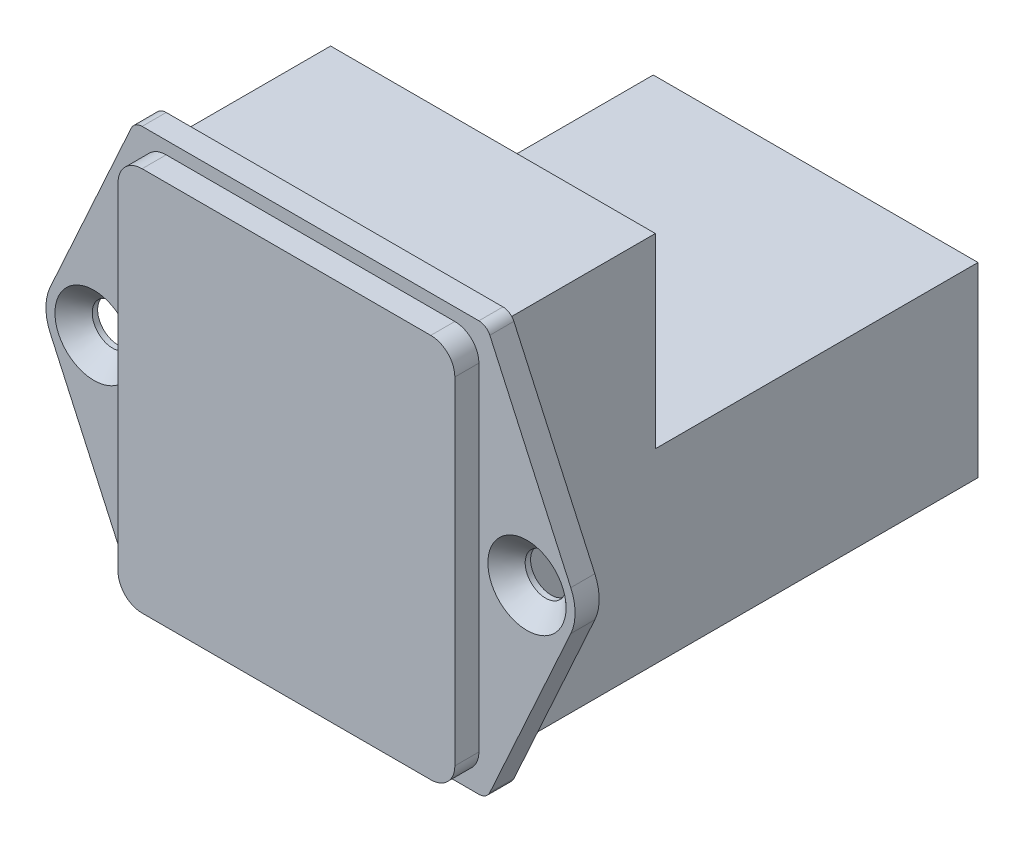
ISO-10303-21;
HEADER;
FILE_DESCRIPTION(('STEP AP214'),'2;1');
FILE_NAME('part.step','',(''),(''),'','','');
FILE_SCHEMA(('AUTOMOTIVE_DESIGN { 1 0 10303 214 1 1 1 1 }'));
ENDSEC;
DATA;
#1=APPLICATION_CONTEXT('core data for automotive mechanical design processes');
#2=APPLICATION_PROTOCOL_DEFINITION('international standard','automotive_design',2000,#1);
#3=PRODUCT_CONTEXT('',#1,'mechanical');
#4=PRODUCT('Part','Part','',(#3));
#5=PRODUCT_RELATED_PRODUCT_CATEGORY('part','',(#4));
#6=PRODUCT_DEFINITION_FORMATION('','',#4);
#7=PRODUCT_DEFINITION_CONTEXT('part definition',#1,'design');
#8=PRODUCT_DEFINITION('design','',#6,#7);
#9=PRODUCT_DEFINITION_SHAPE('','',#8);
#10=(LENGTH_UNIT() NAMED_UNIT(*) SI_UNIT(.MILLI.,.METRE.));
#11=(NAMED_UNIT(*) PLANE_ANGLE_UNIT() SI_UNIT($,.RADIAN.));
#12=(NAMED_UNIT(*) SI_UNIT($,.STERADIAN.) SOLID_ANGLE_UNIT());
#13=UNCERTAINTY_MEASURE_WITH_UNIT(LENGTH_MEASURE(1.E-05),#10,'distance_accuracy_value','');
#14=(GEOMETRIC_REPRESENTATION_CONTEXT(3) GLOBAL_UNCERTAINTY_ASSIGNED_CONTEXT((#13)) GLOBAL_UNIT_ASSIGNED_CONTEXT((#10,
#11,#12)) REPRESENTATION_CONTEXT('',''));
#15=CARTESIAN_POINT('',(0.,0.,0.));
#16=DIRECTION('',(0.,0.,1.));
#17=DIRECTION('',(1.,0.,0.));
#18=AXIS2_PLACEMENT_3D('',#15,#16,#17);
#19=CARTESIAN_POINT('',(-14.,-16.05,2.));
#20=DIRECTION('',(0.,0.,-1.));
#21=DIRECTION('',(-1.,0.,0.));
#22=AXIS2_PLACEMENT_3D('',#19,#20,#21);
#23=PLANE('',#22);
#24=CARTESIAN_POINT('',(-18.,0.,2.));
#25=DIRECTION('',(0.,0.,1.));
#26=DIRECTION('',(1.,0.,0.));
#27=AXIS2_PLACEMENT_3D('',#24,#25,#26);
#28=CIRCLE('',#27,3.25);
#29=CARTESIAN_POINT('',(-14.75,0.,2.));
#30=VERTEX_POINT('',#29);
#31=EDGE_CURVE('E418',#30,#30,#28,.T.);
#32=ORIENTED_EDGE('',*,*,#31,.F.);
#33=EDGE_LOOP('',(#32));
#34=FACE_BOUND('',#33,.T.);
#35=CARTESIAN_POINT('',(-12.,-14.,2.));
#36=DIRECTION('',(0.,0.,1.));
#37=DIRECTION('',(1.,0.,0.));
#38=AXIS2_PLACEMENT_3D('',#35,#36,#37);
#39=CIRCLE('',#38,2.);
#40=CARTESIAN_POINT('',(-14.,-14.,2.));
#41=VERTEX_POINT('',#40);
#42=CARTESIAN_POINT('',(-12.,-16.,2.));
#43=VERTEX_POINT('',#42);
#44=EDGE_CURVE('E257',#41,#43,#39,.T.);
#45=ORIENTED_EDGE('',*,*,#44,.F.);
#46=DIRECTION('',(0.,-1.,0.));
#47=VECTOR('',#46,1.);
#48=CARTESIAN_POINT('',(-14.,14.,2.));
#49=LINE('',#48,#47);
#50=CARTESIAN_POINT('',(-14.,14.,2.));
#51=VERTEX_POINT('',#50);
#52=EDGE_CURVE('E262',#51,#41,#49,.T.);
#53=ORIENTED_EDGE('',*,*,#52,.F.);
#54=CARTESIAN_POINT('',(-12.,14.,2.));
#55=DIRECTION('',(0.,0.,1.));
#56=DIRECTION('',(1.,0.,0.));
#57=AXIS2_PLACEMENT_3D('',#54,#55,#56);
#58=CIRCLE('',#57,2.);
#59=CARTESIAN_POINT('',(-12.,16.,2.));
#60=VERTEX_POINT('',#59);
#61=EDGE_CURVE('E294',#60,#51,#58,.T.);
#62=ORIENTED_EDGE('',*,*,#61,.F.);
#63=DIRECTION('',(-1.,0.,0.));
#64=VECTOR('',#63,1.);
#65=CARTESIAN_POINT('',(-12.,16.,2.));
#66=LINE('',#65,#64);
#67=CARTESIAN_POINT('',(12.,16.,2.));
#68=VERTEX_POINT('',#67);
#69=EDGE_CURVE('E291',#68,#60,#66,.T.);
#70=ORIENTED_EDGE('',*,*,#69,.F.);
#71=CARTESIAN_POINT('',(12.,14.,2.));
#72=DIRECTION('',(0.,0.,1.));
#73=DIRECTION('',(-1.,0.,0.));
#74=AXIS2_PLACEMENT_3D('',#71,#72,#73);
#75=CIRCLE('',#74,2.);
#76=CARTESIAN_POINT('',(14.,14.,2.));
#77=VERTEX_POINT('',#76);
#78=EDGE_CURVE('E288',#77,#68,#75,.T.);
#79=ORIENTED_EDGE('',*,*,#78,.F.);
#80=DIRECTION('',(0.,1.,0.));
#81=VECTOR('',#80,1.);
#82=CARTESIAN_POINT('',(14.,14.,2.));
#83=LINE('',#82,#81);
#84=CARTESIAN_POINT('',(14.,-14.,2.));
#85=VERTEX_POINT('',#84);
#86=EDGE_CURVE('E285',#85,#77,#83,.T.);
#87=ORIENTED_EDGE('',*,*,#86,.F.);
#88=CARTESIAN_POINT('',(12.,-14.,2.));
#89=DIRECTION('',(0.,0.,1.));
#90=DIRECTION('',(1.,0.,0.));
#91=AXIS2_PLACEMENT_3D('',#88,#89,#90);
#92=CIRCLE('',#91,2.);
#93=CARTESIAN_POINT('',(12.,-16.,2.));
#94=VERTEX_POINT('',#93);
#95=EDGE_CURVE('E282',#94,#85,#92,.T.);
#96=ORIENTED_EDGE('',*,*,#95,.F.);
#97=DIRECTION('',(1.,0.,0.));
#98=VECTOR('',#97,1.);
#99=CARTESIAN_POINT('',(-12.,-16.,2.));
#100=LINE('',#99,#98);
#101=EDGE_CURVE('E279',#43,#94,#100,.T.);
#102=ORIENTED_EDGE('',*,*,#101,.F.);
#103=EDGE_LOOP('',(#45,#53,#62,#70,#79,#87,#96,#102));
#104=FACE_BOUND('',#103,.T.);
#105=CARTESIAN_POINT('',(-14.,-16.05,2.));
#106=DIRECTION('',(0.,0.,1.));
#107=DIRECTION('',(-1.,0.,0.));
#108=AXIS2_PLACEMENT_3D('',#105,#106,#107);
#109=CIRCLE('',#108,0.999999999999999);
#110=CARTESIAN_POINT('',(-14.9103682924158,-16.4637989513809,2.));
#111=VERTEX_POINT('',#110);
#112=CARTESIAN_POINT('',(-14.,-17.05,2.));
#113=VERTEX_POINT('',#112);
#114=EDGE_CURVE('E323',#111,#113,#109,.T.);
#115=ORIENTED_EDGE('',*,*,#114,.T.);
#116=DIRECTION('',(1.,0.,0.));
#117=VECTOR('',#116,1.);
#118=CARTESIAN_POINT('',(14.,-17.05,2.));
#119=LINE('',#118,#117);
#120=CARTESIAN_POINT('',(14.,-17.05,2.));
#121=VERTEX_POINT('',#120);
#122=EDGE_CURVE('E326',#113,#121,#119,.T.);
#123=ORIENTED_EDGE('',*,*,#122,.T.);
#124=CARTESIAN_POINT('',(14.,-16.05,2.));
#125=DIRECTION('',(0.,0.,1.));
#126=DIRECTION('',(-1.,0.,0.));
#127=AXIS2_PLACEMENT_3D('',#124,#125,#126);
#128=CIRCLE('',#127,1.);
#129=CARTESIAN_POINT('',(14.9103682924158,-16.4637989513809,2.));
#130=VERTEX_POINT('',#129);
#131=EDGE_CURVE('E329',#121,#130,#128,.T.);
#132=ORIENTED_EDGE('',*,*,#131,.T.);
#133=DIRECTION('',(0.413798951380887,0.91036829241581,0.));
#134=VECTOR('',#133,1.);
#135=CARTESIAN_POINT('',(21.6414731696632,-1.65519580552356,2.));
#136=LINE('',#135,#134);
#137=CARTESIAN_POINT('',(21.6414731696632,-1.65519580552356,2.));
#138=VERTEX_POINT('',#137);
#139=EDGE_CURVE('E331',#130,#138,#136,.T.);
#140=ORIENTED_EDGE('',*,*,#139,.T.);
#141=CARTESIAN_POINT('',(18.,0.,2.));
#142=DIRECTION('',(0.,0.,1.));
#143=DIRECTION('',(1.,0.,0.));
#144=AXIS2_PLACEMENT_3D('',#141,#142,#143);
#145=CIRCLE('',#144,4.);
#146=CARTESIAN_POINT('',(21.6414731696632,1.65519580552355,2.));
#147=VERTEX_POINT('',#146);
#148=EDGE_CURVE('E333',#138,#147,#145,.T.);
#149=ORIENTED_EDGE('',*,*,#148,.T.);
#150=DIRECTION('',(-0.413798951380887,0.91036829241581,0.));
#151=VECTOR('',#150,1.);
#152=CARTESIAN_POINT('',(14.9103682924158,16.4637989513809,2.));
#153=LINE('',#152,#151);
#154=CARTESIAN_POINT('',(14.9103682924158,16.4637989513809,2.));
#155=VERTEX_POINT('',#154);
#156=EDGE_CURVE('E335',#147,#155,#153,.T.);
#157=ORIENTED_EDGE('',*,*,#156,.T.);
#158=CARTESIAN_POINT('',(14.,16.05,2.));
#159=DIRECTION('',(0.,0.,1.));
#160=DIRECTION('',(-1.,0.,0.));
#161=AXIS2_PLACEMENT_3D('',#158,#159,#160);
#162=CIRCLE('',#161,1.);
#163=CARTESIAN_POINT('',(14.,17.05,2.));
#164=VERTEX_POINT('',#163);
#165=EDGE_CURVE('E337',#155,#164,#162,.T.);
#166=ORIENTED_EDGE('',*,*,#165,.T.);
#167=DIRECTION('',(-1.,0.,0.));
#168=VECTOR('',#167,1.);
#169=CARTESIAN_POINT('',(-14.,17.05,2.));
#170=LINE('',#169,#168);
#171=CARTESIAN_POINT('',(-14.,17.05,2.));
#172=VERTEX_POINT('',#171);
#173=EDGE_CURVE('E339',#164,#172,#170,.T.);
#174=ORIENTED_EDGE('',*,*,#173,.T.);
#175=CARTESIAN_POINT('',(-14.,16.05,2.));
#176=DIRECTION('',(0.,0.,1.));
#177=DIRECTION('',(-1.,0.,0.));
#178=AXIS2_PLACEMENT_3D('',#175,#176,#177);
#179=CIRCLE('',#178,1.);
#180=CARTESIAN_POINT('',(-14.9103682924158,16.4637989513809,2.));
#181=VERTEX_POINT('',#180);
#182=EDGE_CURVE('E341',#172,#181,#179,.T.);
#183=ORIENTED_EDGE('',*,*,#182,.T.);
#184=DIRECTION('',(-0.413798951380887,-0.91036829241581,0.));
#185=VECTOR('',#184,1.);
#186=CARTESIAN_POINT('',(-21.6414731696632,1.65519580552355,2.));
#187=LINE('',#186,#185);
#188=CARTESIAN_POINT('',(-21.6414731696632,1.65519580552355,2.));
#189=VERTEX_POINT('',#188);
#190=EDGE_CURVE('E343',#181,#189,#187,.T.);
#191=ORIENTED_EDGE('',*,*,#190,.T.);
#192=CARTESIAN_POINT('',(-18.,0.,2.));
#193=DIRECTION('',(0.,0.,1.));
#194=DIRECTION('',(1.,0.,0.));
#195=AXIS2_PLACEMENT_3D('',#192,#193,#194);
#196=CIRCLE('',#195,4.);
#197=CARTESIAN_POINT('',(-21.6414731696632,-1.65519580552355,2.));
#198=VERTEX_POINT('',#197);
#199=EDGE_CURVE('E345',#189,#198,#196,.T.);
#200=ORIENTED_EDGE('',*,*,#199,.T.);
#201=DIRECTION('',(0.413798951380887,-0.91036829241581,0.));
#202=VECTOR('',#201,1.);
#203=CARTESIAN_POINT('',(-14.9103682924158,-16.4637989513809,2.));
#204=LINE('',#203,#202);
#205=EDGE_CURVE('E347',#198,#111,#204,.T.);
#206=ORIENTED_EDGE('',*,*,#205,.T.);
#207=EDGE_LOOP('',(#115,#123,#132,#140,#149,#157,#166,#174,#183,#191,#200,#206));
#208=FACE_BOUND('',#207,.T.);
#209=CARTESIAN_POINT('',(18.,0.,2.));
#210=DIRECTION('',(0.,0.,1.));
#211=DIRECTION('',(1.,0.,0.));
#212=AXIS2_PLACEMENT_3D('',#209,#210,#211);
#213=CIRCLE('',#212,3.25);
#214=CARTESIAN_POINT('',(21.25,0.,2.));
#215=VERTEX_POINT('',#214);
#216=EDGE_CURVE('E408',#215,#215,#213,.T.);
#217=ORIENTED_EDGE('',*,*,#216,.F.);
#218=EDGE_LOOP('',(#217));
#219=FACE_BOUND('',#218,.T.);
#220=ADVANCED_FACE('F33',(#34,#104,#208,#219),#23,.F.);
#221=CARTESIAN_POINT('',(-14.,-16.05,0.));
#222=DIRECTION('',(0.,0.,-1.));
#223=DIRECTION('',(-1.,0.,0.));
#224=AXIS2_PLACEMENT_3D('',#221,#222,#223);
#225=PLANE('',#224);
#226=CARTESIAN_POINT('',(-18.,0.,0.));
#227=DIRECTION('',(0.,0.,-1.));
#228=DIRECTION('',(-1.,0.,0.));
#229=AXIS2_PLACEMENT_3D('',#226,#227,#228);
#230=CIRCLE('',#229,1.69999999999999);
#231=CARTESIAN_POINT('',(-19.7,0.,0.));
#232=VERTEX_POINT('',#231);
#233=EDGE_CURVE('E37',#232,#232,#230,.T.);
#234=ORIENTED_EDGE('',*,*,#233,.F.);
#235=EDGE_LOOP('',(#234));
#236=FACE_BOUND('',#235,.T.);
#237=CARTESIAN_POINT('',(18.,0.,0.));
#238=DIRECTION('',(0.,0.,-1.));
#239=DIRECTION('',(-1.,0.,0.));
#240=AXIS2_PLACEMENT_3D('',#237,#238,#239);
#241=CIRCLE('',#240,1.69999999999999);
#242=CARTESIAN_POINT('',(16.3,0.,0.));
#243=VERTEX_POINT('',#242);
#244=EDGE_CURVE('E237',#243,#243,#241,.T.);
#245=ORIENTED_EDGE('',*,*,#244,.F.);
#246=EDGE_LOOP('',(#245));
#247=FACE_BOUND('',#246,.T.);
#248=CARTESIAN_POINT('',(-14.,-16.05,0.));
#249=DIRECTION('',(0.,0.,1.));
#250=DIRECTION('',(-1.,0.,0.));
#251=AXIS2_PLACEMENT_3D('',#248,#249,#250);
#252=CIRCLE('',#251,0.999999999999999);
#253=CARTESIAN_POINT('',(-14.9103682924158,-16.4637989513809,0.));
#254=VERTEX_POINT('',#253);
#255=CARTESIAN_POINT('',(-14.,-17.05,0.));
#256=VERTEX_POINT('',#255);
#257=EDGE_CURVE('E322',#254,#256,#252,.T.);
#258=ORIENTED_EDGE('',*,*,#257,.F.);
#259=DIRECTION('',(0.413798951380887,-0.91036829241581,0.));
#260=VECTOR('',#259,1.);
#261=CARTESIAN_POINT('',(-14.9103682924158,-16.4637989513809,0.));
#262=LINE('',#261,#260);
#263=CARTESIAN_POINT('',(-21.6414731696632,-1.65519580552355,0.));
#264=VERTEX_POINT('',#263);
#265=EDGE_CURVE('E327',#264,#254,#262,.T.);
#266=ORIENTED_EDGE('',*,*,#265,.F.);
#267=CARTESIAN_POINT('',(-18.,0.,0.));
#268=DIRECTION('',(0.,0.,1.));
#269=DIRECTION('',(1.,0.,0.));
#270=AXIS2_PLACEMENT_3D('',#267,#268,#269);
#271=CIRCLE('',#270,4.);
#272=CARTESIAN_POINT('',(-21.6414731696632,1.65519580552355,0.));
#273=VERTEX_POINT('',#272);
#274=EDGE_CURVE('E370',#273,#264,#271,.T.);
#275=ORIENTED_EDGE('',*,*,#274,.F.);
#276=DIRECTION('',(-0.413798951380887,-0.91036829241581,0.));
#277=VECTOR('',#276,1.);
#278=CARTESIAN_POINT('',(-21.6414731696632,1.65519580552355,0.));
#279=LINE('',#278,#277);
#280=CARTESIAN_POINT('',(-14.9103682924158,16.4637989513809,0.));
#281=VERTEX_POINT('',#280);
#282=EDGE_CURVE('E368',#281,#273,#279,.T.);
#283=ORIENTED_EDGE('',*,*,#282,.F.);
#284=CARTESIAN_POINT('',(-14.,16.05,0.));
#285=DIRECTION('',(0.,0.,1.));
#286=DIRECTION('',(-1.,0.,0.));
#287=AXIS2_PLACEMENT_3D('',#284,#285,#286);
#288=CIRCLE('',#287,1.);
#289=CARTESIAN_POINT('',(-14.,17.05,0.));
#290=VERTEX_POINT('',#289);
#291=EDGE_CURVE('E366',#290,#281,#288,.T.);
#292=ORIENTED_EDGE('',*,*,#291,.F.);
#293=DIRECTION('',(-1.,0.,0.));
#294=VECTOR('',#293,1.);
#295=CARTESIAN_POINT('',(-14.,17.05,0.));
#296=LINE('',#295,#294);
#297=CARTESIAN_POINT('',(14.,17.05,0.));
#298=VERTEX_POINT('',#297);
#299=EDGE_CURVE('E364',#298,#290,#296,.T.);
#300=ORIENTED_EDGE('',*,*,#299,.F.);
#301=CARTESIAN_POINT('',(14.,16.05,0.));
#302=DIRECTION('',(0.,0.,1.));
#303=DIRECTION('',(-1.,0.,0.));
#304=AXIS2_PLACEMENT_3D('',#301,#302,#303);
#305=CIRCLE('',#304,1.);
#306=CARTESIAN_POINT('',(14.9103682924158,16.4637989513809,0.));
#307=VERTEX_POINT('',#306);
#308=EDGE_CURVE('E362',#307,#298,#305,.T.);
#309=ORIENTED_EDGE('',*,*,#308,.F.);
#310=DIRECTION('',(-0.413798951380887,0.91036829241581,0.));
#311=VECTOR('',#310,1.);
#312=CARTESIAN_POINT('',(14.9103682924158,16.4637989513809,0.));
#313=LINE('',#312,#311);
#314=CARTESIAN_POINT('',(21.6414731696632,1.65519580552355,0.));
#315=VERTEX_POINT('',#314);
#316=EDGE_CURVE('E360',#315,#307,#313,.T.);
#317=ORIENTED_EDGE('',*,*,#316,.F.);
#318=CARTESIAN_POINT('',(18.,0.,0.));
#319=DIRECTION('',(0.,0.,1.));
#320=DIRECTION('',(1.,0.,0.));
#321=AXIS2_PLACEMENT_3D('',#318,#319,#320);
#322=CIRCLE('',#321,4.);
#323=CARTESIAN_POINT('',(21.6414731696632,-1.65519580552356,0.));
#324=VERTEX_POINT('',#323);
#325=EDGE_CURVE('E358',#324,#315,#322,.T.);
#326=ORIENTED_EDGE('',*,*,#325,.F.);
#327=DIRECTION('',(0.413798951380887,0.91036829241581,0.));
#328=VECTOR('',#327,1.);
#329=CARTESIAN_POINT('',(21.6414731696632,-1.65519580552356,0.));
#330=LINE('',#329,#328);
#331=CARTESIAN_POINT('',(14.9103682924158,-16.4637989513809,0.));
#332=VERTEX_POINT('',#331);
#333=EDGE_CURVE('E356',#332,#324,#330,.T.);
#334=ORIENTED_EDGE('',*,*,#333,.F.);
#335=CARTESIAN_POINT('',(14.,-16.05,0.));
#336=DIRECTION('',(0.,0.,1.));
#337=DIRECTION('',(-1.,0.,0.));
#338=AXIS2_PLACEMENT_3D('',#335,#336,#337);
#339=CIRCLE('',#338,1.);
#340=CARTESIAN_POINT('',(14.,-17.05,0.));
#341=VERTEX_POINT('',#340);
#342=EDGE_CURVE('E354',#341,#332,#339,.T.);
#343=ORIENTED_EDGE('',*,*,#342,.F.);
#344=DIRECTION('',(1.,0.,0.));
#345=VECTOR('',#344,1.);
#346=CARTESIAN_POINT('',(14.,-17.05,0.));
#347=LINE('',#346,#345);
#348=EDGE_CURVE('E352',#256,#341,#347,.T.);
#349=ORIENTED_EDGE('',*,*,#348,.F.);
#350=EDGE_LOOP('',(#258,#266,#275,#283,#292,#300,#309,#317,#326,#334,#343,#349));
#351=FACE_BOUND('',#350,.T.);
#352=DIRECTION('',(-1.,0.,0.));
#353=VECTOR('',#352,1.);
#354=CARTESIAN_POINT('',(13.5,-15.5,0.));
#355=LINE('',#354,#353);
#356=CARTESIAN_POINT('',(13.5,-15.5,0.));
#357=VERTEX_POINT('',#356);
#358=CARTESIAN_POINT('',(-13.5,-15.5,0.));
#359=VERTEX_POINT('',#358);
#360=EDGE_CURVE('E50',#357,#359,#355,.T.);
#361=ORIENTED_EDGE('',*,*,#360,.F.);
#362=DIRECTION('',(0.,-1.,0.));
#363=VECTOR('',#362,1.);
#364=CARTESIAN_POINT('',(13.5,-15.5,0.));
#365=LINE('',#364,#363);
#366=CARTESIAN_POINT('',(13.5,15.5,0.));
#367=VERTEX_POINT('',#366);
#368=EDGE_CURVE('E55',#367,#357,#365,.T.);
#369=ORIENTED_EDGE('',*,*,#368,.F.);
#370=DIRECTION('',(-1.,0.,0.));
#371=VECTOR('',#370,1.);
#372=CARTESIAN_POINT('',(13.5,15.5,0.));
#373=LINE('',#372,#371);
#374=CARTESIAN_POINT('',(-13.5,15.5,0.));
#375=VERTEX_POINT('',#374);
#376=EDGE_CURVE('E234',#367,#375,#373,.T.);
#377=ORIENTED_EDGE('',*,*,#376,.T.);
#378=DIRECTION('',(0.,-1.,0.));
#379=VECTOR('',#378,1.);
#380=CARTESIAN_POINT('',(-13.5,-15.5,0.));
#381=LINE('',#380,#379);
#382=EDGE_CURVE('E235',#375,#359,#381,.T.);
#383=ORIENTED_EDGE('',*,*,#382,.T.);
#384=EDGE_LOOP('',(#361,#369,#377,#383));
#385=FACE_BOUND('',#384,.T.);
#386=ADVANCED_FACE('F426',(#236,#247,#351,#385),#225,.T.);
#387=CARTESIAN_POINT('',(-14.,-16.05,2.));
#388=DIRECTION('',(0.,0.,-1.));
#389=DIRECTION('',(-1.,0.,0.));
#390=AXIS2_PLACEMENT_3D('',#387,#388,#389);
#391=CYLINDRICAL_SURFACE('',#390,0.999999999999999);
#392=ORIENTED_EDGE('',*,*,#257,.T.);
#393=DIRECTION('',(0.,0.,-1.));
#394=VECTOR('',#393,1.);
#395=CARTESIAN_POINT('',(-14.,-17.05,2.));
#396=LINE('',#395,#394);
#397=EDGE_CURVE('E11',#113,#256,#396,.T.);
#398=ORIENTED_EDGE('',*,*,#397,.F.);
#399=ORIENTED_EDGE('',*,*,#114,.F.);
#400=DIRECTION('',(0.,0.,-1.));
#401=VECTOR('',#400,1.);
#402=CARTESIAN_POINT('',(-14.9103682924158,-16.4637989513809,2.));
#403=LINE('',#402,#401);
#404=EDGE_CURVE('E349',#111,#254,#403,.T.);
#405=ORIENTED_EDGE('',*,*,#404,.T.);
#406=EDGE_LOOP('',(#392,#398,#399,#405));
#407=FACE_BOUND('',#406,.T.);
#408=ADVANCED_FACE('F35',(#407),#391,.T.);
#409=CARTESIAN_POINT('',(14.,-17.05,2.));
#410=DIRECTION('',(0.,1.,0.));
#411=DIRECTION('',(0.,0.,1.));
#412=AXIS2_PLACEMENT_3D('',#409,#410,#411);
#413=PLANE('',#412);
#414=ORIENTED_EDGE('',*,*,#348,.T.);
#415=DIRECTION('',(0.,0.,-1.));
#416=VECTOR('',#415,1.);
#417=CARTESIAN_POINT('',(14.,-17.05,2.));
#418=LINE('',#417,#416);
#419=EDGE_CURVE('E42',#121,#341,#418,.T.);
#420=ORIENTED_EDGE('',*,*,#419,.F.);
#421=ORIENTED_EDGE('',*,*,#122,.F.);
#422=ORIENTED_EDGE('',*,*,#397,.T.);
#423=EDGE_LOOP('',(#414,#420,#421,#422));
#424=FACE_BOUND('',#423,.T.);
#425=ADVANCED_FACE('F548',(#424),#413,.F.);
#426=CARTESIAN_POINT('',(14.,-16.05,2.));
#427=DIRECTION('',(0.,0.,-1.));
#428=DIRECTION('',(-1.,0.,0.));
#429=AXIS2_PLACEMENT_3D('',#426,#427,#428);
#430=CYLINDRICAL_SURFACE('',#429,1.);
#431=ORIENTED_EDGE('',*,*,#342,.T.);
#432=DIRECTION('',(0.,0.,-1.));
#433=VECTOR('',#432,1.);
#434=CARTESIAN_POINT('',(14.9103682924158,-16.4637989513809,2.));
#435=LINE('',#434,#433);
#436=EDGE_CURVE('E399',#130,#332,#435,.T.);
#437=ORIENTED_EDGE('',*,*,#436,.F.);
#438=ORIENTED_EDGE('',*,*,#131,.F.);
#439=ORIENTED_EDGE('',*,*,#419,.T.);
#440=EDGE_LOOP('',(#431,#437,#438,#439));
#441=FACE_BOUND('',#440,.T.);
#442=ADVANCED_FACE('F545',(#441),#430,.T.);
#443=CARTESIAN_POINT('',(21.6414731696632,-1.65519580552356,2.));
#444=DIRECTION('',(-0.91036829241581,0.413798951380887,0.));
#445=DIRECTION('',(-0.413798951380887,-0.91036829241581,0.));
#446=AXIS2_PLACEMENT_3D('',#443,#444,#445);
#447=PLANE('',#446);
#448=ORIENTED_EDGE('',*,*,#333,.T.);
#449=DIRECTION('',(0.,0.,-1.));
#450=VECTOR('',#449,1.);
#451=CARTESIAN_POINT('',(21.6414731696632,-1.65519580552356,2.));
#452=LINE('',#451,#450);
#453=EDGE_CURVE('E396',#138,#324,#452,.T.);
#454=ORIENTED_EDGE('',*,*,#453,.F.);
#455=ORIENTED_EDGE('',*,*,#139,.F.);
#456=ORIENTED_EDGE('',*,*,#436,.T.);
#457=EDGE_LOOP('',(#448,#454,#455,#456));
#458=FACE_BOUND('',#457,.T.);
#459=ADVANCED_FACE('F541',(#458),#447,.F.);
#460=CARTESIAN_POINT('',(18.,0.,2.));
#461=DIRECTION('',(0.,0.,-1.));
#462=DIRECTION('',(-1.,0.,0.));
#463=AXIS2_PLACEMENT_3D('',#460,#461,#462);
#464=CYLINDRICAL_SURFACE('',#463,4.);
#465=ORIENTED_EDGE('',*,*,#325,.T.);
#466=DIRECTION('',(0.,0.,-1.));
#467=VECTOR('',#466,1.);
#468=CARTESIAN_POINT('',(21.6414731696632,1.65519580552355,2.));
#469=LINE('',#468,#467);
#470=EDGE_CURVE('E393',#147,#315,#469,.T.);
#471=ORIENTED_EDGE('',*,*,#470,.F.);
#472=ORIENTED_EDGE('',*,*,#148,.F.);
#473=ORIENTED_EDGE('',*,*,#453,.T.);
#474=EDGE_LOOP('',(#465,#471,#472,#473));
#475=FACE_BOUND('',#474,.T.);
#476=ADVANCED_FACE('F537',(#475),#464,.T.);
#477=CARTESIAN_POINT('',(14.9103682924158,16.4637989513809,2.));
#478=DIRECTION('',(-0.91036829241581,-0.413798951380887,0.));
#479=DIRECTION('',(0.413798951380887,-0.91036829241581,0.));
#480=AXIS2_PLACEMENT_3D('',#477,#478,#479);
#481=PLANE('',#480);
#482=ORIENTED_EDGE('',*,*,#316,.T.);
#483=DIRECTION('',(0.,0.,-1.));
#484=VECTOR('',#483,1.);
#485=CARTESIAN_POINT('',(14.9103682924158,16.4637989513809,2.));
#486=LINE('',#485,#484);
#487=EDGE_CURVE('E390',#155,#307,#486,.T.);
#488=ORIENTED_EDGE('',*,*,#487,.F.);
#489=ORIENTED_EDGE('',*,*,#156,.F.);
#490=ORIENTED_EDGE('',*,*,#470,.T.);
#491=EDGE_LOOP('',(#482,#488,#489,#490));
#492=FACE_BOUND('',#491,.T.);
#493=ADVANCED_FACE('F533',(#492),#481,.F.);
#494=CARTESIAN_POINT('',(14.,16.05,2.));
#495=DIRECTION('',(0.,0.,-1.));
#496=DIRECTION('',(-1.,0.,0.));
#497=AXIS2_PLACEMENT_3D('',#494,#495,#496);
#498=CYLINDRICAL_SURFACE('',#497,1.);
#499=ORIENTED_EDGE('',*,*,#308,.T.);
#500=DIRECTION('',(0.,0.,-1.));
#501=VECTOR('',#500,1.);
#502=CARTESIAN_POINT('',(14.,17.05,2.));
#503=LINE('',#502,#501);
#504=EDGE_CURVE('E387',#164,#298,#503,.T.);
#505=ORIENTED_EDGE('',*,*,#504,.F.);
#506=ORIENTED_EDGE('',*,*,#165,.F.);
#507=ORIENTED_EDGE('',*,*,#487,.T.);
#508=EDGE_LOOP('',(#499,#505,#506,#507));
#509=FACE_BOUND('',#508,.T.);
#510=ADVANCED_FACE('F529',(#509),#498,.T.);
#511=CARTESIAN_POINT('',(-14.,17.05,2.));
#512=DIRECTION('',(0.,-1.,0.));
#513=DIRECTION('',(0.,0.,-1.));
#514=AXIS2_PLACEMENT_3D('',#511,#512,#513);
#515=PLANE('',#514);
#516=ORIENTED_EDGE('',*,*,#299,.T.);
#517=DIRECTION('',(0.,0.,-1.));
#518=VECTOR('',#517,1.);
#519=CARTESIAN_POINT('',(-14.,17.05,2.));
#520=LINE('',#519,#518);
#521=EDGE_CURVE('E384',#172,#290,#520,.T.);
#522=ORIENTED_EDGE('',*,*,#521,.F.);
#523=ORIENTED_EDGE('',*,*,#173,.F.);
#524=ORIENTED_EDGE('',*,*,#504,.T.);
#525=EDGE_LOOP('',(#516,#522,#523,#524));
#526=FACE_BOUND('',#525,.T.);
#527=ADVANCED_FACE('F525',(#526),#515,.F.);
#528=CARTESIAN_POINT('',(-14.,16.05,2.));
#529=DIRECTION('',(0.,0.,-1.));
#530=DIRECTION('',(-1.,0.,0.));
#531=AXIS2_PLACEMENT_3D('',#528,#529,#530);
#532=CYLINDRICAL_SURFACE('',#531,1.);
#533=ORIENTED_EDGE('',*,*,#291,.T.);
#534=DIRECTION('',(0.,0.,-1.));
#535=VECTOR('',#534,1.);
#536=CARTESIAN_POINT('',(-14.9103682924158,16.4637989513809,2.));
#537=LINE('',#536,#535);
#538=EDGE_CURVE('E381',#181,#281,#537,.T.);
#539=ORIENTED_EDGE('',*,*,#538,.F.);
#540=ORIENTED_EDGE('',*,*,#182,.F.);
#541=ORIENTED_EDGE('',*,*,#521,.T.);
#542=EDGE_LOOP('',(#533,#539,#540,#541));
#543=FACE_BOUND('',#542,.T.);
#544=ADVANCED_FACE('F521',(#543),#532,.T.);
#545=CARTESIAN_POINT('',(-21.6414731696632,1.65519580552355,2.));
#546=DIRECTION('',(0.91036829241581,-0.413798951380887,0.));
#547=DIRECTION('',(0.413798951380887,0.91036829241581,0.));
#548=AXIS2_PLACEMENT_3D('',#545,#546,#547);
#549=PLANE('',#548);
#550=ORIENTED_EDGE('',*,*,#282,.T.);
#551=DIRECTION('',(0.,0.,-1.));
#552=VECTOR('',#551,1.);
#553=CARTESIAN_POINT('',(-21.6414731696632,1.65519580552355,2.));
#554=LINE('',#553,#552);
#555=EDGE_CURVE('E378',#189,#273,#554,.T.);
#556=ORIENTED_EDGE('',*,*,#555,.F.);
#557=ORIENTED_EDGE('',*,*,#190,.F.);
#558=ORIENTED_EDGE('',*,*,#538,.T.);
#559=EDGE_LOOP('',(#550,#556,#557,#558));
#560=FACE_BOUND('',#559,.T.);
#561=ADVANCED_FACE('F517',(#560),#549,.F.);
#562=CARTESIAN_POINT('',(-18.,0.,2.));
#563=DIRECTION('',(0.,0.,-1.));
#564=DIRECTION('',(-1.,0.,0.));
#565=AXIS2_PLACEMENT_3D('',#562,#563,#564);
#566=CYLINDRICAL_SURFACE('',#565,4.);
#567=ORIENTED_EDGE('',*,*,#274,.T.);
#568=DIRECTION('',(0.,0.,-1.));
#569=VECTOR('',#568,1.);
#570=CARTESIAN_POINT('',(-21.6414731696632,-1.65519580552355,2.));
#571=LINE('',#570,#569);
#572=EDGE_CURVE('E375',#198,#264,#571,.T.);
#573=ORIENTED_EDGE('',*,*,#572,.F.);
#574=ORIENTED_EDGE('',*,*,#199,.F.);
#575=ORIENTED_EDGE('',*,*,#555,.T.);
#576=EDGE_LOOP('',(#567,#573,#574,#575));
#577=FACE_BOUND('',#576,.T.);
#578=ADVANCED_FACE('F513',(#577),#566,.T.);
#579=CARTESIAN_POINT('',(-14.9103682924158,-16.4637989513809,2.));
#580=DIRECTION('',(0.91036829241581,0.413798951380887,0.));
#581=DIRECTION('',(-0.413798951380887,0.91036829241581,0.));
#582=AXIS2_PLACEMENT_3D('',#579,#580,#581);
#583=PLANE('',#582);
#584=ORIENTED_EDGE('',*,*,#265,.T.);
#585=ORIENTED_EDGE('',*,*,#404,.F.);
#586=ORIENTED_EDGE('',*,*,#205,.F.);
#587=ORIENTED_EDGE('',*,*,#572,.T.);
#588=EDGE_LOOP('',(#584,#585,#586,#587));
#589=FACE_BOUND('',#588,.T.);
#590=ADVANCED_FACE('F505',(#589),#583,.F.);
#591=CARTESIAN_POINT('',(-12.,-14.,4.));
#592=DIRECTION('',(0.,0.,-1.));
#593=DIRECTION('',(-1.,0.,0.));
#594=AXIS2_PLACEMENT_3D('',#591,#592,#593);
#595=CYLINDRICAL_SURFACE('',#594,2.);
#596=ORIENTED_EDGE('',*,*,#44,.T.);
#597=DIRECTION('',(0.,0.,-1.));
#598=VECTOR('',#597,1.);
#599=CARTESIAN_POINT('',(-12.,-16.,4.));
#600=LINE('',#599,#598);
#601=CARTESIAN_POINT('',(-12.,-16.,4.));
#602=VERTEX_POINT('',#601);
#603=EDGE_CURVE('E319',#602,#43,#600,.T.);
#604=ORIENTED_EDGE('',*,*,#603,.F.);
#605=CARTESIAN_POINT('',(-12.,-14.,4.));
#606=DIRECTION('',(0.,0.,1.));
#607=DIRECTION('',(1.,0.,0.));
#608=AXIS2_PLACEMENT_3D('',#605,#606,#607);
#609=CIRCLE('',#608,2.);
#610=CARTESIAN_POINT('',(-14.,-14.,4.));
#611=VERTEX_POINT('',#610);
#612=EDGE_CURVE('E258',#611,#602,#609,.T.);
#613=ORIENTED_EDGE('',*,*,#612,.F.);
#614=DIRECTION('',(0.,0.,-1.));
#615=VECTOR('',#614,1.);
#616=CARTESIAN_POINT('',(-14.,-14.,4.));
#617=LINE('',#616,#615);
#618=EDGE_CURVE('E276',#611,#41,#617,.T.);
#619=ORIENTED_EDGE('',*,*,#618,.T.);
#620=EDGE_LOOP('',(#596,#604,#613,#619));
#621=FACE_BOUND('',#620,.T.);
#622=ADVANCED_FACE('F502',(#621),#595,.T.);
#623=CARTESIAN_POINT('',(-12.,-16.,4.));
#624=DIRECTION('',(0.,1.,0.));
#625=DIRECTION('',(0.,0.,1.));
#626=AXIS2_PLACEMENT_3D('',#623,#624,#625);
#627=PLANE('',#626);
#628=ORIENTED_EDGE('',*,*,#101,.T.);
#629=DIRECTION('',(0.,0.,-1.));
#630=VECTOR('',#629,1.);
#631=CARTESIAN_POINT('',(12.,-16.,4.));
#632=LINE('',#631,#630);
#633=CARTESIAN_POINT('',(12.,-16.,4.));
#634=VERTEX_POINT('',#633);
#635=EDGE_CURVE('E316',#634,#94,#632,.T.);
#636=ORIENTED_EDGE('',*,*,#635,.F.);
#637=DIRECTION('',(1.,0.,0.));
#638=VECTOR('',#637,1.);
#639=CARTESIAN_POINT('',(-12.,-16.,4.));
#640=LINE('',#639,#638);
#641=EDGE_CURVE('E261',#602,#634,#640,.T.);
#642=ORIENTED_EDGE('',*,*,#641,.F.);
#643=ORIENTED_EDGE('',*,*,#603,.T.);
#644=EDGE_LOOP('',(#628,#636,#642,#643));
#645=FACE_BOUND('',#644,.T.);
#646=ADVANCED_FACE('F498',(#645),#627,.F.);
#647=CARTESIAN_POINT('',(12.,-14.,4.));
#648=DIRECTION('',(0.,0.,-1.));
#649=DIRECTION('',(-1.,0.,0.));
#650=AXIS2_PLACEMENT_3D('',#647,#648,#649);
#651=CYLINDRICAL_SURFACE('',#650,2.);
#652=ORIENTED_EDGE('',*,*,#95,.T.);
#653=DIRECTION('',(0.,0.,-1.));
#654=VECTOR('',#653,1.);
#655=CARTESIAN_POINT('',(14.,-14.,4.));
#656=LINE('',#655,#654);
#657=CARTESIAN_POINT('',(14.,-14.,4.));
#658=VERTEX_POINT('',#657);
#659=EDGE_CURVE('E313',#658,#85,#656,.T.);
#660=ORIENTED_EDGE('',*,*,#659,.F.);
#661=CARTESIAN_POINT('',(12.,-14.,4.));
#662=DIRECTION('',(0.,0.,1.));
#663=DIRECTION('',(1.,0.,0.));
#664=AXIS2_PLACEMENT_3D('',#661,#662,#663);
#665=CIRCLE('',#664,2.);
#666=EDGE_CURVE('E264',#634,#658,#665,.T.);
#667=ORIENTED_EDGE('',*,*,#666,.F.);
#668=ORIENTED_EDGE('',*,*,#635,.T.);
#669=EDGE_LOOP('',(#652,#660,#667,#668));
#670=FACE_BOUND('',#669,.T.);
#671=ADVANCED_FACE('F494',(#670),#651,.T.);
#672=CARTESIAN_POINT('',(14.,14.,4.));
#673=DIRECTION('',(-1.,0.,0.));
#674=DIRECTION('',(0.,-1.,0.));
#675=AXIS2_PLACEMENT_3D('',#672,#673,#674);
#676=PLANE('',#675);
#677=ORIENTED_EDGE('',*,*,#86,.T.);
#678=DIRECTION('',(0.,0.,-1.));
#679=VECTOR('',#678,1.);
#680=CARTESIAN_POINT('',(14.,14.,4.));
#681=LINE('',#680,#679);
#682=CARTESIAN_POINT('',(14.,14.,4.));
#683=VERTEX_POINT('',#682);
#684=EDGE_CURVE('E310',#683,#77,#681,.T.);
#685=ORIENTED_EDGE('',*,*,#684,.F.);
#686=DIRECTION('',(0.,1.,0.));
#687=VECTOR('',#686,1.);
#688=CARTESIAN_POINT('',(14.,14.,4.));
#689=LINE('',#688,#687);
#690=EDGE_CURVE('E266',#658,#683,#689,.T.);
#691=ORIENTED_EDGE('',*,*,#690,.F.);
#692=ORIENTED_EDGE('',*,*,#659,.T.);
#693=EDGE_LOOP('',(#677,#685,#691,#692));
#694=FACE_BOUND('',#693,.T.);
#695=ADVANCED_FACE('F490',(#694),#676,.F.);
#696=CARTESIAN_POINT('',(12.,14.,4.));
#697=DIRECTION('',(0.,0.,-1.));
#698=DIRECTION('',(-1.,0.,0.));
#699=AXIS2_PLACEMENT_3D('',#696,#697,#698);
#700=CYLINDRICAL_SURFACE('',#699,2.);
#701=ORIENTED_EDGE('',*,*,#78,.T.);
#702=DIRECTION('',(0.,0.,-1.));
#703=VECTOR('',#702,1.);
#704=CARTESIAN_POINT('',(12.,16.,4.));
#705=LINE('',#704,#703);
#706=CARTESIAN_POINT('',(12.,16.,4.));
#707=VERTEX_POINT('',#706);
#708=EDGE_CURVE('E307',#707,#68,#705,.T.);
#709=ORIENTED_EDGE('',*,*,#708,.F.);
#710=CARTESIAN_POINT('',(12.,14.,4.));
#711=DIRECTION('',(0.,0.,1.));
#712=DIRECTION('',(-1.,0.,0.));
#713=AXIS2_PLACEMENT_3D('',#710,#711,#712);
#714=CIRCLE('',#713,2.);
#715=EDGE_CURVE('E268',#683,#707,#714,.T.);
#716=ORIENTED_EDGE('',*,*,#715,.F.);
#717=ORIENTED_EDGE('',*,*,#684,.T.);
#718=EDGE_LOOP('',(#701,#709,#716,#717));
#719=FACE_BOUND('',#718,.T.);
#720=ADVANCED_FACE('F486',(#719),#700,.T.);
#721=CARTESIAN_POINT('',(-12.,16.,4.));
#722=DIRECTION('',(0.,-1.,0.));
#723=DIRECTION('',(1.,0.,0.));
#724=AXIS2_PLACEMENT_3D('',#721,#722,#723);
#725=PLANE('',#724);
#726=ORIENTED_EDGE('',*,*,#69,.T.);
#727=DIRECTION('',(0.,0.,-1.));
#728=VECTOR('',#727,1.);
#729=CARTESIAN_POINT('',(-12.,16.,4.));
#730=LINE('',#729,#728);
#731=CARTESIAN_POINT('',(-12.,16.,4.));
#732=VERTEX_POINT('',#731);
#733=EDGE_CURVE('E304',#732,#60,#730,.T.);
#734=ORIENTED_EDGE('',*,*,#733,.F.);
#735=DIRECTION('',(-1.,0.,0.));
#736=VECTOR('',#735,1.);
#737=CARTESIAN_POINT('',(-12.,16.,4.));
#738=LINE('',#737,#736);
#739=EDGE_CURVE('E270',#707,#732,#738,.T.);
#740=ORIENTED_EDGE('',*,*,#739,.F.);
#741=ORIENTED_EDGE('',*,*,#708,.T.);
#742=EDGE_LOOP('',(#726,#734,#740,#741));
#743=FACE_BOUND('',#742,.T.);
#744=ADVANCED_FACE('F482',(#743),#725,.F.);
#745=CARTESIAN_POINT('',(-12.,14.,4.));
#746=DIRECTION('',(0.,0.,-1.));
#747=DIRECTION('',(-1.,0.,0.));
#748=AXIS2_PLACEMENT_3D('',#745,#746,#747);
#749=CYLINDRICAL_SURFACE('',#748,2.);
#750=ORIENTED_EDGE('',*,*,#61,.T.);
#751=DIRECTION('',(0.,0.,-1.));
#752=VECTOR('',#751,1.);
#753=CARTESIAN_POINT('',(-14.,14.,4.));
#754=LINE('',#753,#752);
#755=CARTESIAN_POINT('',(-14.,14.,4.));
#756=VERTEX_POINT('',#755);
#757=EDGE_CURVE('E301',#756,#51,#754,.T.);
#758=ORIENTED_EDGE('',*,*,#757,.F.);
#759=CARTESIAN_POINT('',(-12.,14.,4.));
#760=DIRECTION('',(0.,0.,1.));
#761=DIRECTION('',(1.,0.,0.));
#762=AXIS2_PLACEMENT_3D('',#759,#760,#761);
#763=CIRCLE('',#762,2.);
#764=EDGE_CURVE('E272',#732,#756,#763,.T.);
#765=ORIENTED_EDGE('',*,*,#764,.F.);
#766=ORIENTED_EDGE('',*,*,#733,.T.);
#767=EDGE_LOOP('',(#750,#758,#765,#766));
#768=FACE_BOUND('',#767,.T.);
#769=ADVANCED_FACE('F478',(#768),#749,.T.);
#770=CARTESIAN_POINT('',(-14.,14.,4.));
#771=DIRECTION('',(1.,0.,0.));
#772=DIRECTION('',(0.,1.,0.));
#773=AXIS2_PLACEMENT_3D('',#770,#771,#772);
#774=PLANE('',#773);
#775=ORIENTED_EDGE('',*,*,#52,.T.);
#776=ORIENTED_EDGE('',*,*,#618,.F.);
#777=DIRECTION('',(0.,-1.,0.));
#778=VECTOR('',#777,1.);
#779=CARTESIAN_POINT('',(-14.,14.,4.));
#780=LINE('',#779,#778);
#781=EDGE_CURVE('E274',#756,#611,#780,.T.);
#782=ORIENTED_EDGE('',*,*,#781,.F.);
#783=ORIENTED_EDGE('',*,*,#757,.T.);
#784=EDGE_LOOP('',(#775,#776,#782,#783));
#785=FACE_BOUND('',#784,.T.);
#786=ADVANCED_FACE('F474',(#785),#774,.F.);
#787=CARTESIAN_POINT('',(-12.,-14.,4.));
#788=DIRECTION('',(0.,0.,1.));
#789=DIRECTION('',(1.,0.,0.));
#790=AXIS2_PLACEMENT_3D('',#787,#788,#789);
#791=PLANE('',#790);
#792=ORIENTED_EDGE('',*,*,#612,.T.);
#793=ORIENTED_EDGE('',*,*,#641,.T.);
#794=ORIENTED_EDGE('',*,*,#666,.T.);
#795=ORIENTED_EDGE('',*,*,#690,.T.);
#796=ORIENTED_EDGE('',*,*,#715,.T.);
#797=ORIENTED_EDGE('',*,*,#739,.T.);
#798=ORIENTED_EDGE('',*,*,#764,.T.);
#799=ORIENTED_EDGE('',*,*,#781,.T.);
#800=EDGE_LOOP('',(#792,#793,#794,#795,#796,#797,#798,#799));
#801=FACE_BOUND('',#800,.T.);
#802=ADVANCED_FACE('F471',(#801),#791,.T.);
#803=CARTESIAN_POINT('',(13.5,-15.5,-40.));
#804=DIRECTION('',(0.,1.,0.));
#805=DIRECTION('',(0.,0.,1.));
#806=AXIS2_PLACEMENT_3D('',#803,#804,#805);
#807=PLANE('',#806);
#808=DIRECTION('',(0.,0.,-1.));
#809=VECTOR('',#808,1.);
#810=CARTESIAN_POINT('',(-13.5,-15.5,-40.));
#811=LINE('',#810,#809);
#812=CARTESIAN_POINT('',(-13.5,-15.5,-40.));
#813=VERTEX_POINT('',#812);
#814=EDGE_CURVE('E217',#359,#813,#811,.T.);
#815=ORIENTED_EDGE('',*,*,#814,.T.);
#816=DIRECTION('',(-1.,0.,0.));
#817=VECTOR('',#816,1.);
#818=CARTESIAN_POINT('',(13.5,-15.5,-40.));
#819=LINE('',#818,#817);
#820=CARTESIAN_POINT('',(13.5,-15.5,-40.));
#821=VERTEX_POINT('',#820);
#822=EDGE_CURVE('E214',#821,#813,#819,.T.);
#823=ORIENTED_EDGE('',*,*,#822,.F.);
#824=DIRECTION('',(0.,0.,-1.));
#825=VECTOR('',#824,1.);
#826=CARTESIAN_POINT('',(13.5,-15.5,-40.));
#827=LINE('',#826,#825);
#828=EDGE_CURVE('E205',#357,#821,#827,.T.);
#829=ORIENTED_EDGE('',*,*,#828,.F.);
#830=ORIENTED_EDGE('',*,*,#360,.T.);
#831=EDGE_LOOP('',(#815,#823,#829,#830));
#832=FACE_BOUND('',#831,.T.);
#833=ADVANCED_FACE('F215',(#832),#807,.F.);
#834=CARTESIAN_POINT('',(13.5,0.,-40.));
#835=DIRECTION('',(0.,0.,1.));
#836=DIRECTION('',(1.,0.,0.));
#837=AXIS2_PLACEMENT_3D('',#834,#835,#836);
#838=PLANE('',#837);
#839=DIRECTION('',(0.,1.,0.));
#840=VECTOR('',#839,1.);
#841=CARTESIAN_POINT('',(-13.5,0.,-40.));
#842=LINE('',#841,#840);
#843=CARTESIAN_POINT('',(-13.5,0.,-40.));
#844=VERTEX_POINT('',#843);
#845=EDGE_CURVE('E239',#813,#844,#842,.T.);
#846=ORIENTED_EDGE('',*,*,#845,.T.);
#847=DIRECTION('',(-1.,0.,0.));
#848=VECTOR('',#847,1.);
#849=CARTESIAN_POINT('',(13.5,0.,-40.));
#850=LINE('',#849,#848);
#851=CARTESIAN_POINT('',(13.5,0.,-40.));
#852=VERTEX_POINT('',#851);
#853=EDGE_CURVE('E220',#852,#844,#850,.T.);
#854=ORIENTED_EDGE('',*,*,#853,.F.);
#855=DIRECTION('',(0.,1.,0.));
#856=VECTOR('',#855,1.);
#857=CARTESIAN_POINT('',(13.5,0.,-40.));
#858=LINE('',#857,#856);
#859=EDGE_CURVE('E209',#821,#852,#858,.T.);
#860=ORIENTED_EDGE('',*,*,#859,.F.);
#861=ORIENTED_EDGE('',*,*,#822,.T.);
#862=EDGE_LOOP('',(#846,#854,#860,#861));
#863=FACE_BOUND('',#862,.T.);
#864=ADVANCED_FACE('F222',(#863),#838,.F.);
#865=CARTESIAN_POINT('',(13.5,0.,-13.1716362494693));
#866=DIRECTION('',(0.,-1.,0.));
#867=DIRECTION('',(0.,0.,-1.));
#868=AXIS2_PLACEMENT_3D('',#865,#866,#867);
#869=PLANE('',#868);
#870=DIRECTION('',(0.,0.,1.));
#871=VECTOR('',#870,1.);
#872=CARTESIAN_POINT('',(-13.5,0.,-13.1716362494693));
#873=LINE('',#872,#871);
#874=CARTESIAN_POINT('',(-13.5,0.,-13.1716362494693));
#875=VERTEX_POINT('',#874);
#876=EDGE_CURVE('E241',#844,#875,#873,.T.);
#877=ORIENTED_EDGE('',*,*,#876,.T.);
#878=DIRECTION('',(-1.,0.,0.));
#879=VECTOR('',#878,1.);
#880=CARTESIAN_POINT('',(13.5,0.,-13.1716362494693));
#881=LINE('',#880,#879);
#882=CARTESIAN_POINT('',(13.5,0.,-13.1716362494693));
#883=VERTEX_POINT('',#882);
#884=EDGE_CURVE('E252',#883,#875,#881,.T.);
#885=ORIENTED_EDGE('',*,*,#884,.F.);
#886=DIRECTION('',(0.,0.,1.));
#887=VECTOR('',#886,1.);
#888=CARTESIAN_POINT('',(13.5,0.,-13.1716362494693));
#889=LINE('',#888,#887);
#890=EDGE_CURVE('E225',#852,#883,#889,.T.);
#891=ORIENTED_EDGE('',*,*,#890,.F.);
#892=ORIENTED_EDGE('',*,*,#853,.T.);
#893=EDGE_LOOP('',(#877,#885,#891,#892));
#894=FACE_BOUND('',#893,.T.);
#895=ADVANCED_FACE('F462',(#894),#869,.F.);
#896=CARTESIAN_POINT('',(13.5,15.5,-13.1716362494693));
#897=DIRECTION('',(0.,0.,1.));
#898=DIRECTION('',(0.,-1.,0.));
#899=AXIS2_PLACEMENT_3D('',#896,#897,#898);
#900=PLANE('',#899);
#901=DIRECTION('',(0.,1.,0.));
#902=VECTOR('',#901,1.);
#903=CARTESIAN_POINT('',(-13.5,15.5,-13.1716362494693));
#904=LINE('',#903,#902);
#905=CARTESIAN_POINT('',(-13.5,15.5,-13.1716362494693));
#906=VERTEX_POINT('',#905);
#907=EDGE_CURVE('E243',#875,#906,#904,.T.);
#908=ORIENTED_EDGE('',*,*,#907,.T.);
#909=DIRECTION('',(-1.,0.,0.));
#910=VECTOR('',#909,1.);
#911=CARTESIAN_POINT('',(13.5,15.5,-13.1716362494693));
#912=LINE('',#911,#910);
#913=CARTESIAN_POINT('',(13.5,15.5,-13.1716362494693));
#914=VERTEX_POINT('',#913);
#915=EDGE_CURVE('E249',#914,#906,#912,.T.);
#916=ORIENTED_EDGE('',*,*,#915,.F.);
#917=DIRECTION('',(0.,1.,0.));
#918=VECTOR('',#917,1.);
#919=CARTESIAN_POINT('',(13.5,15.5,-13.1716362494693));
#920=LINE('',#919,#918);
#921=EDGE_CURVE('E227',#883,#914,#920,.T.);
#922=ORIENTED_EDGE('',*,*,#921,.F.);
#923=ORIENTED_EDGE('',*,*,#884,.T.);
#924=EDGE_LOOP('',(#908,#916,#922,#923));
#925=FACE_BOUND('',#924,.T.);
#926=ADVANCED_FACE('F458',(#925),#900,.F.);
#927=CARTESIAN_POINT('',(13.5,15.5,0.));
#928=DIRECTION('',(0.,-1.,0.));
#929=DIRECTION('',(0.,0.,-1.));
#930=AXIS2_PLACEMENT_3D('',#927,#928,#929);
#931=PLANE('',#930);
#932=DIRECTION('',(0.,0.,1.));
#933=VECTOR('',#932,1.);
#934=CARTESIAN_POINT('',(-13.5,15.5,0.));
#935=LINE('',#934,#933);
#936=EDGE_CURVE('E245',#906,#375,#935,.T.);
#937=ORIENTED_EDGE('',*,*,#936,.T.);
#938=ORIENTED_EDGE('',*,*,#376,.F.);
#939=DIRECTION('',(0.,0.,1.));
#940=VECTOR('',#939,1.);
#941=CARTESIAN_POINT('',(13.5,15.5,0.));
#942=LINE('',#941,#940);
#943=EDGE_CURVE('E232',#914,#367,#942,.T.);
#944=ORIENTED_EDGE('',*,*,#943,.F.);
#945=ORIENTED_EDGE('',*,*,#915,.T.);
#946=EDGE_LOOP('',(#937,#938,#944,#945));
#947=FACE_BOUND('',#946,.T.);
#948=ADVANCED_FACE('F452',(#947),#931,.F.);
#949=CARTESIAN_POINT('',(13.5,15.5,0.));
#950=DIRECTION('',(-1.,0.,0.));
#951=DIRECTION('',(0.,0.,1.));
#952=AXIS2_PLACEMENT_3D('',#949,#950,#951);
#953=PLANE('',#952);
#954=ORIENTED_EDGE('',*,*,#368,.T.);
#955=ORIENTED_EDGE('',*,*,#828,.T.);
#956=ORIENTED_EDGE('',*,*,#859,.T.);
#957=ORIENTED_EDGE('',*,*,#890,.T.);
#958=ORIENTED_EDGE('',*,*,#921,.T.);
#959=ORIENTED_EDGE('',*,*,#943,.T.);
#960=EDGE_LOOP('',(#954,#955,#956,#957,#958,#959));
#961=FACE_BOUND('',#960,.T.);
#962=ADVANCED_FACE('F207',(#961),#953,.F.);
#963=CARTESIAN_POINT('',(-13.5,15.5,0.));
#964=DIRECTION('',(-1.,0.,0.));
#965=DIRECTION('',(0.,0.,1.));
#966=AXIS2_PLACEMENT_3D('',#963,#964,#965);
#967=PLANE('',#966);
#968=ORIENTED_EDGE('',*,*,#382,.F.);
#969=ORIENTED_EDGE('',*,*,#936,.F.);
#970=ORIENTED_EDGE('',*,*,#907,.F.);
#971=ORIENTED_EDGE('',*,*,#876,.F.);
#972=ORIENTED_EDGE('',*,*,#845,.F.);
#973=ORIENTED_EDGE('',*,*,#814,.F.);
#974=EDGE_LOOP('',(#968,#969,#970,#971,#972,#973));
#975=FACE_BOUND('',#974,.T.);
#976=ADVANCED_FACE('F446',(#975),#967,.T.);
#977=CARTESIAN_POINT('',(18.,0.,2.));
#978=DIRECTION('',(0.,0.,1.));
#979=DIRECTION('',(1.,0.,0.));
#980=AXIS2_PLACEMENT_3D('',#977,#978,#979);
#981=CYLINDRICAL_SURFACE('',#980,1.69999999999999);
#982=ORIENTED_EDGE('',*,*,#244,.T.);
#983=EDGE_LOOP('',(#982));
#984=FACE_BOUND('',#983,.T.);
#985=CARTESIAN_POINT('',(18.,0.,0.449999999999999));
#986=DIRECTION('',(0.,0.,1.));
#987=DIRECTION('',(1.,0.,0.));
#988=AXIS2_PLACEMENT_3D('',#985,#986,#987);
#989=CIRCLE('',#988,1.7);
#990=CARTESIAN_POINT('',(19.7,0.,0.449999999999999));
#991=VERTEX_POINT('',#990);
#992=EDGE_CURVE('E404',#991,#991,#989,.T.);
#993=ORIENTED_EDGE('',*,*,#992,.T.);
#994=EDGE_LOOP('',(#993));
#995=FACE_BOUND('',#994,.T.);
#996=ADVANCED_FACE('F437',(#984,#995),#981,.F.);
#997=CARTESIAN_POINT('',(18.,0.,2.));
#998=DIRECTION('',(0.,0.,1.));
#999=DIRECTION('',(1.,0.,0.));
#1000=AXIS2_PLACEMENT_3D('',#997,#998,#999);
#1001=CONICAL_SURFACE('',#1000,3.25,0.785398163397447);
#1002=ORIENTED_EDGE('',*,*,#992,.F.);
#1003=EDGE_LOOP('',(#1002));
#1004=FACE_BOUND('',#1003,.T.);
#1005=ORIENTED_EDGE('',*,*,#216,.T.);
#1006=EDGE_LOOP('',(#1005));
#1007=FACE_BOUND('',#1006,.T.);
#1008=ADVANCED_FACE('F434',(#1004,#1007),#1001,.F.);
#1009=CARTESIAN_POINT('',(-18.,0.,2.));
#1010=DIRECTION('',(0.,0.,1.));
#1011=DIRECTION('',(1.,0.,0.));
#1012=AXIS2_PLACEMENT_3D('',#1009,#1010,#1011);
#1013=CYLINDRICAL_SURFACE('',#1012,1.69999999999999);
#1014=ORIENTED_EDGE('',*,*,#233,.T.);
#1015=EDGE_LOOP('',(#1014));
#1016=FACE_BOUND('',#1015,.T.);
#1017=CARTESIAN_POINT('',(-18.,0.,0.449999999999999));
#1018=DIRECTION('',(0.,0.,1.));
#1019=DIRECTION('',(1.,0.,0.));
#1020=AXIS2_PLACEMENT_3D('',#1017,#1018,#1019);
#1021=CIRCLE('',#1020,1.7);
#1022=CARTESIAN_POINT('',(-16.3,0.,0.449999999999999));
#1023=VERTEX_POINT('',#1022);
#1024=EDGE_CURVE('E415',#1023,#1023,#1021,.T.);
#1025=ORIENTED_EDGE('',*,*,#1024,.T.);
#1026=EDGE_LOOP('',(#1025));
#1027=FACE_BOUND('',#1026,.T.);
#1028=ADVANCED_FACE('F436',(#1016,#1027),#1013,.F.);
#1029=CARTESIAN_POINT('',(-18.,0.,2.));
#1030=DIRECTION('',(0.,0.,1.));
#1031=DIRECTION('',(1.,0.,0.));
#1032=AXIS2_PLACEMENT_3D('',#1029,#1030,#1031);
#1033=CONICAL_SURFACE('',#1032,3.25,0.785398163397447);
#1034=ORIENTED_EDGE('',*,*,#1024,.F.);
#1035=EDGE_LOOP('',(#1034));
#1036=FACE_BOUND('',#1035,.T.);
#1037=ORIENTED_EDGE('',*,*,#31,.T.);
#1038=EDGE_LOOP('',(#1037));
#1039=FACE_BOUND('',#1038,.T.);
#1040=ADVANCED_FACE('F422',(#1036,#1039),#1033,.F.);
#1041=CLOSED_SHELL('',(#220,#386,#408,#425,#442,#459,#476,#493,#510,#527,#544,#561,#578,#590,
#622,#646,#671,#695,#720,#744,#769,#786,#802,#833,#864,#895,#926,#948,#962,#976,#996,#1008,
#1028,#1040));
#1042=MANIFOLD_SOLID_BREP('B2',#1041);
#1043=ADVANCED_BREP_SHAPE_REPRESENTATION('',(#18,#1042),#14);
#1044=SHAPE_DEFINITION_REPRESENTATION(#9,#1043);
ENDSEC;
END-ISO-10303-21;
